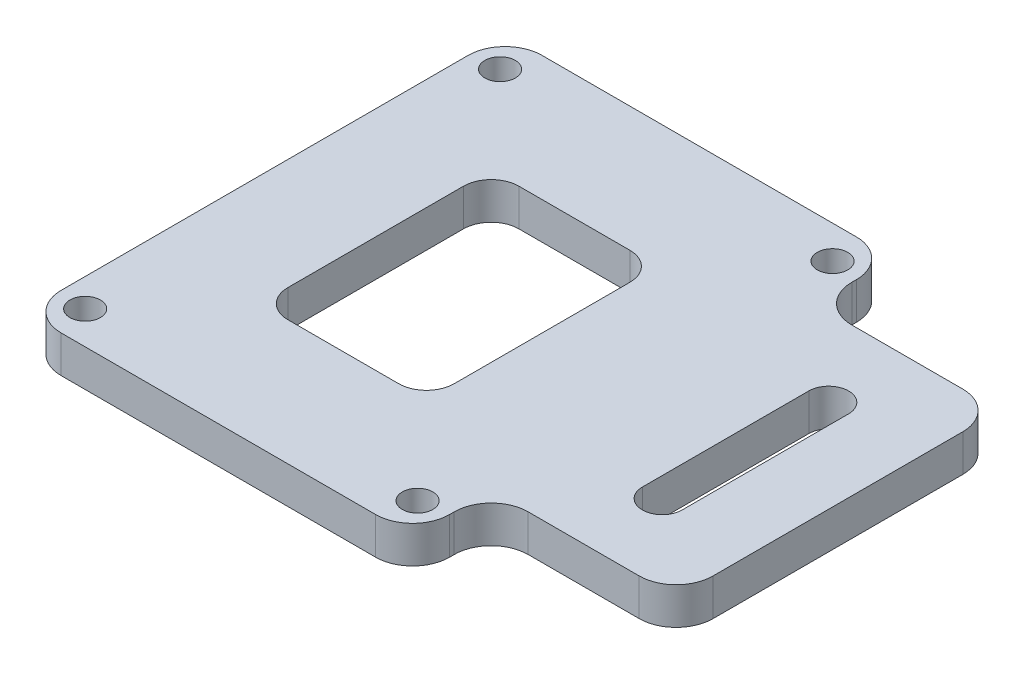
ISO-10303-21;
HEADER;
FILE_DESCRIPTION(('STEP AP214'),'2;1');
FILE_NAME('part.step','',(''),(''),'','','');
FILE_SCHEMA(('AUTOMOTIVE_DESIGN { 1 0 10303 214 1 1 1 1 }'));
ENDSEC;
DATA;
#1=APPLICATION_CONTEXT('core data for automotive mechanical design processes');
#2=APPLICATION_PROTOCOL_DEFINITION('international standard','automotive_design',2000,#1);
#3=PRODUCT_CONTEXT('',#1,'mechanical');
#4=PRODUCT('Part','Part','',(#3));
#5=PRODUCT_RELATED_PRODUCT_CATEGORY('part','',(#4));
#6=PRODUCT_DEFINITION_FORMATION('','',#4);
#7=PRODUCT_DEFINITION_CONTEXT('part definition',#1,'design');
#8=PRODUCT_DEFINITION('design','',#6,#7);
#9=PRODUCT_DEFINITION_SHAPE('','',#8);
#10=(LENGTH_UNIT() NAMED_UNIT(*) SI_UNIT(.MILLI.,.METRE.));
#11=(NAMED_UNIT(*) PLANE_ANGLE_UNIT() SI_UNIT($,.RADIAN.));
#12=(NAMED_UNIT(*) SI_UNIT($,.STERADIAN.) SOLID_ANGLE_UNIT());
#13=UNCERTAINTY_MEASURE_WITH_UNIT(LENGTH_MEASURE(1.E-05),#10,'distance_accuracy_value','');
#14=(GEOMETRIC_REPRESENTATION_CONTEXT(3) GLOBAL_UNCERTAINTY_ASSIGNED_CONTEXT((#13)) GLOBAL_UNIT_ASSIGNED_CONTEXT((#10,
#11,#12)) REPRESENTATION_CONTEXT('',''));
#15=CARTESIAN_POINT('',(0.,0.,0.));
#16=DIRECTION('',(0.,0.,1.));
#17=DIRECTION('',(1.,0.,0.));
#18=AXIS2_PLACEMENT_3D('',#15,#16,#17);
#19=CARTESIAN_POINT('',(21.,4.,26.));
#20=DIRECTION('',(-1.,0.,0.));
#21=DIRECTION('',(0.,0.,1.));
#22=AXIS2_PLACEMENT_3D('',#19,#20,#21);
#23=PLANE('',#22);
#24=DIRECTION('',(0.,0.,-1.));
#25=VECTOR('',#24,1.);
#26=CARTESIAN_POINT('',(21.,4.,26.));
#27=LINE('',#26,#25);
#28=CARTESIAN_POINT('',(21.,4.,-21.5));
#29=VERTEX_POINT('',#28);
#30=CARTESIAN_POINT('',(21.,4.,-22.));
#31=VERTEX_POINT('',#30);
#32=EDGE_CURVE('E309',#29,#31,#27,.T.);
#33=ORIENTED_EDGE('',*,*,#32,.F.);
#34=DIRECTION('',(0.,1.,0.));
#35=VECTOR('',#34,1.);
#36=CARTESIAN_POINT('',(21.,4.,-21.5));
#37=LINE('',#36,#35);
#38=CARTESIAN_POINT('',(21.,0.,-21.5));
#39=VERTEX_POINT('',#38);
#40=EDGE_CURVE('E337',#29,#39,#37,.F.);
#41=ORIENTED_EDGE('',*,*,#40,.T.);
#42=DIRECTION('',(0.,0.,-1.));
#43=VECTOR('',#42,1.);
#44=CARTESIAN_POINT('',(21.,0.,26.));
#45=LINE('',#44,#43);
#46=CARTESIAN_POINT('',(21.,0.,-22.));
#47=VERTEX_POINT('',#46);
#48=EDGE_CURVE('E304',#39,#47,#45,.T.);
#49=ORIENTED_EDGE('',*,*,#48,.T.);
#50=DIRECTION('',(0.,-1.,0.));
#51=VECTOR('',#50,1.);
#52=CARTESIAN_POINT('',(21.,4.,-22.));
#53=LINE('',#52,#51);
#54=EDGE_CURVE('E335',#47,#31,#53,.F.);
#55=ORIENTED_EDGE('',*,*,#54,.T.);
#56=EDGE_LOOP('',(#33,#41,#49,#55));
#57=FACE_BOUND('',#56,.T.);
#58=ADVANCED_FACE('F35',(#57),#23,.F.);
#59=CARTESIAN_POINT('',(21.,0.,22.));
#60=VERTEX_POINT('',#59);
#61=CARTESIAN_POINT('',(21.,0.,21.5));
#62=VERTEX_POINT('',#61);
#63=EDGE_CURVE('E319',#60,#62,#45,.T.);
#64=ORIENTED_EDGE('',*,*,#63,.T.);
#65=DIRECTION('',(0.,1.,0.));
#66=VECTOR('',#65,1.);
#67=CARTESIAN_POINT('',(21.,4.,21.5));
#68=LINE('',#67,#66);
#69=CARTESIAN_POINT('',(21.,4.,21.5));
#70=VERTEX_POINT('',#69);
#71=EDGE_CURVE('E342',#62,#70,#68,.T.);
#72=ORIENTED_EDGE('',*,*,#71,.T.);
#73=CARTESIAN_POINT('',(21.,4.,22.));
#74=VERTEX_POINT('',#73);
#75=EDGE_CURVE('E305',#74,#70,#27,.T.);
#76=ORIENTED_EDGE('',*,*,#75,.F.);
#77=DIRECTION('',(0.,-1.,0.));
#78=VECTOR('',#77,1.);
#79=CARTESIAN_POINT('',(21.,4.,22.));
#80=LINE('',#79,#78);
#81=EDGE_CURVE('E339',#74,#60,#80,.T.);
#82=ORIENTED_EDGE('',*,*,#81,.T.);
#83=EDGE_LOOP('',(#64,#72,#76,#82));
#84=FACE_BOUND('',#83,.T.);
#85=ADVANCED_FACE('F495',(#84),#23,.F.);
#86=CARTESIAN_POINT('',(-21.,4.,-26.));
#87=DIRECTION('',(0.,0.,1.));
#88=DIRECTION('',(1.,0.,0.));
#89=AXIS2_PLACEMENT_3D('',#86,#87,#88);
#90=PLANE('',#89);
#91=DIRECTION('',(-1.,0.,0.));
#92=VECTOR('',#91,1.);
#93=CARTESIAN_POINT('',(-21.,4.,-26.));
#94=LINE('',#93,#92);
#95=CARTESIAN_POINT('',(17.,4.,-26.));
#96=VERTEX_POINT('',#95);
#97=CARTESIAN_POINT('',(-17.,4.,-26.));
#98=VERTEX_POINT('',#97);
#99=EDGE_CURVE('E308',#96,#98,#94,.T.);
#100=ORIENTED_EDGE('',*,*,#99,.F.);
#101=DIRECTION('',(0.,-1.,0.));
#102=VECTOR('',#101,1.);
#103=CARTESIAN_POINT('',(17.,4.,-26.));
#104=LINE('',#103,#102);
#105=CARTESIAN_POINT('',(17.,0.,-26.));
#106=VERTEX_POINT('',#105);
#107=EDGE_CURVE('E381',#96,#106,#104,.T.);
#108=ORIENTED_EDGE('',*,*,#107,.T.);
#109=DIRECTION('',(-1.,0.,0.));
#110=VECTOR('',#109,1.);
#111=CARTESIAN_POINT('',(-21.,0.,-26.));
#112=LINE('',#111,#110);
#113=CARTESIAN_POINT('',(-17.,0.,-26.));
#114=VERTEX_POINT('',#113);
#115=EDGE_CURVE('E322',#106,#114,#112,.T.);
#116=ORIENTED_EDGE('',*,*,#115,.T.);
#117=DIRECTION('',(0.,-1.,0.));
#118=VECTOR('',#117,1.);
#119=CARTESIAN_POINT('',(-17.,4.,-26.));
#120=LINE('',#119,#118);
#121=EDGE_CURVE('E379',#114,#98,#120,.F.);
#122=ORIENTED_EDGE('',*,*,#121,.T.);
#123=EDGE_LOOP('',(#100,#108,#116,#122));
#124=FACE_BOUND('',#123,.T.);
#125=ADVANCED_FACE('F501',(#124),#90,.F.);
#126=CARTESIAN_POINT('',(-21.,4.,26.));
#127=DIRECTION('',(1.,0.,0.));
#128=DIRECTION('',(0.,0.,-1.));
#129=AXIS2_PLACEMENT_3D('',#126,#127,#128);
#130=PLANE('',#129);
#131=DIRECTION('',(0.,0.,1.));
#132=VECTOR('',#131,1.);
#133=CARTESIAN_POINT('',(-21.,0.,26.));
#134=LINE('',#133,#132);
#135=CARTESIAN_POINT('',(-21.,0.,-22.));
#136=VERTEX_POINT('',#135);
#137=CARTESIAN_POINT('',(-21.,0.,22.));
#138=VERTEX_POINT('',#137);
#139=EDGE_CURVE('E325',#136,#138,#134,.T.);
#140=ORIENTED_EDGE('',*,*,#139,.T.);
#141=DIRECTION('',(0.,-1.,0.));
#142=VECTOR('',#141,1.);
#143=CARTESIAN_POINT('',(-21.,4.,22.));
#144=LINE('',#143,#142);
#145=CARTESIAN_POINT('',(-21.,4.,22.));
#146=VERTEX_POINT('',#145);
#147=EDGE_CURVE('E392',#138,#146,#144,.F.);
#148=ORIENTED_EDGE('',*,*,#147,.T.);
#149=DIRECTION('',(0.,0.,1.));
#150=VECTOR('',#149,1.);
#151=CARTESIAN_POINT('',(-21.,4.,26.));
#152=LINE('',#151,#150);
#153=CARTESIAN_POINT('',(-21.,4.,-22.));
#154=VERTEX_POINT('',#153);
#155=EDGE_CURVE('E312',#154,#146,#152,.T.);
#156=ORIENTED_EDGE('',*,*,#155,.F.);
#157=DIRECTION('',(0.,-1.,0.));
#158=VECTOR('',#157,1.);
#159=CARTESIAN_POINT('',(-21.,4.,-22.));
#160=LINE('',#159,#158);
#161=EDGE_CURVE('E389',#154,#136,#160,.T.);
#162=ORIENTED_EDGE('',*,*,#161,.T.);
#163=EDGE_LOOP('',(#140,#148,#156,#162));
#164=FACE_BOUND('',#163,.T.);
#165=ADVANCED_FACE('F598',(#164),#130,.F.);
#166=CARTESIAN_POINT('',(-21.,4.,26.));
#167=DIRECTION('',(0.,0.,-1.));
#168=DIRECTION('',(-1.,0.,0.));
#169=AXIS2_PLACEMENT_3D('',#166,#167,#168);
#170=PLANE('',#169);
#171=DIRECTION('',(1.,0.,0.));
#172=VECTOR('',#171,1.);
#173=CARTESIAN_POINT('',(-21.,0.,26.));
#174=LINE('',#173,#172);
#175=CARTESIAN_POINT('',(-17.,0.,26.));
#176=VERTEX_POINT('',#175);
#177=CARTESIAN_POINT('',(17.,0.,26.));
#178=VERTEX_POINT('',#177);
#179=EDGE_CURVE('E328',#176,#178,#174,.T.);
#180=ORIENTED_EDGE('',*,*,#179,.T.);
#181=DIRECTION('',(0.,-1.,0.));
#182=VECTOR('',#181,1.);
#183=CARTESIAN_POINT('',(17.,4.,26.));
#184=LINE('',#183,#182);
#185=CARTESIAN_POINT('',(17.,4.,26.));
#186=VERTEX_POINT('',#185);
#187=EDGE_CURVE('E387',#178,#186,#184,.F.);
#188=ORIENTED_EDGE('',*,*,#187,.T.);
#189=DIRECTION('',(1.,0.,0.));
#190=VECTOR('',#189,1.);
#191=CARTESIAN_POINT('',(-21.,4.,26.));
#192=LINE('',#191,#190);
#193=CARTESIAN_POINT('',(-17.,4.,26.));
#194=VERTEX_POINT('',#193);
#195=EDGE_CURVE('E315',#194,#186,#192,.T.);
#196=ORIENTED_EDGE('',*,*,#195,.F.);
#197=DIRECTION('',(0.,-1.,0.));
#198=VECTOR('',#197,1.);
#199=CARTESIAN_POINT('',(-17.,4.,26.));
#200=LINE('',#199,#198);
#201=EDGE_CURVE('E384',#194,#176,#200,.T.);
#202=ORIENTED_EDGE('',*,*,#201,.T.);
#203=EDGE_LOOP('',(#180,#188,#196,#202));
#204=FACE_BOUND('',#203,.T.);
#205=ADVANCED_FACE('F594',(#204),#170,.F.);
#206=CARTESIAN_POINT('',(0.,4.,0.));
#207=DIRECTION('',(0.,-1.,0.));
#208=DIRECTION('',(0.,0.,-1.));
#209=AXIS2_PLACEMENT_3D('',#206,#207,#208);
#210=PLANE('',#209);
#211=DIRECTION('',(0.,0.,-1.));
#212=VECTOR('',#211,1.);
#213=CARTESIAN_POINT('',(-9.,4.,0.));
#214=LINE('',#213,#212);
#215=CARTESIAN_POINT('',(-9.,4.,9.5));
#216=VERTEX_POINT('',#215);
#217=CARTESIAN_POINT('',(-9.,4.,-9.5));
#218=VERTEX_POINT('',#217);
#219=EDGE_CURVE('E466',#216,#218,#214,.T.);
#220=ORIENTED_EDGE('',*,*,#219,.T.);
#221=CARTESIAN_POINT('',(-6.,4.,-9.5));
#222=DIRECTION('',(0.,-1.,0.));
#223=DIRECTION('',(0.,0.,-1.));
#224=AXIS2_PLACEMENT_3D('',#221,#222,#223);
#225=CIRCLE('',#224,3.);
#226=CARTESIAN_POINT('',(-6.,4.,-12.5));
#227=VERTEX_POINT('',#226);
#228=EDGE_CURVE('E57',#218,#227,#225,.T.);
#229=ORIENTED_EDGE('',*,*,#228,.T.);
#230=DIRECTION('',(1.,0.,0.));
#231=VECTOR('',#230,1.);
#232=CARTESIAN_POINT('',(0.,4.,-12.5));
#233=LINE('',#232,#231);
#234=CARTESIAN_POINT('',(6.,4.,-12.5));
#235=VERTEX_POINT('',#234);
#236=EDGE_CURVE('E440',#227,#235,#233,.T.);
#237=ORIENTED_EDGE('',*,*,#236,.T.);
#238=CARTESIAN_POINT('',(6.,4.,-9.5));
#239=DIRECTION('',(0.,-1.,0.));
#240=DIRECTION('',(0.,0.,-1.));
#241=AXIS2_PLACEMENT_3D('',#238,#239,#240);
#242=CIRCLE('',#241,3.);
#243=CARTESIAN_POINT('',(9.,4.,-9.5));
#244=VERTEX_POINT('',#243);
#245=EDGE_CURVE('E43',#235,#244,#242,.T.);
#246=ORIENTED_EDGE('',*,*,#245,.T.);
#247=DIRECTION('',(0.,0.,1.));
#248=VECTOR('',#247,1.);
#249=CARTESIAN_POINT('',(9.,4.,0.));
#250=LINE('',#249,#248);
#251=CARTESIAN_POINT('',(9.,4.,9.5));
#252=VERTEX_POINT('',#251);
#253=EDGE_CURVE('E246',#244,#252,#250,.T.);
#254=ORIENTED_EDGE('',*,*,#253,.T.);
#255=CARTESIAN_POINT('',(6.,4.,9.5));
#256=DIRECTION('',(0.,-1.,0.));
#257=DIRECTION('',(0.,0.,-1.));
#258=AXIS2_PLACEMENT_3D('',#255,#256,#257);
#259=CIRCLE('',#258,3.);
#260=CARTESIAN_POINT('',(6.,4.,12.5));
#261=VERTEX_POINT('',#260);
#262=EDGE_CURVE('E427',#252,#261,#259,.T.);
#263=ORIENTED_EDGE('',*,*,#262,.T.);
#264=DIRECTION('',(-1.,0.,0.));
#265=VECTOR('',#264,1.);
#266=CARTESIAN_POINT('',(0.,4.,12.5));
#267=LINE('',#266,#265);
#268=CARTESIAN_POINT('',(-6.,4.,12.5));
#269=VERTEX_POINT('',#268);
#270=EDGE_CURVE('E249',#261,#269,#267,.T.);
#271=ORIENTED_EDGE('',*,*,#270,.T.);
#272=CARTESIAN_POINT('',(-6.,4.,9.5));
#273=DIRECTION('',(0.,-1.,0.));
#274=DIRECTION('',(0.,0.,-1.));
#275=AXIS2_PLACEMENT_3D('',#272,#273,#274);
#276=CIRCLE('',#275,3.);
#277=EDGE_CURVE('E431',#269,#216,#276,.T.);
#278=ORIENTED_EDGE('',*,*,#277,.T.);
#279=EDGE_LOOP('',(#220,#229,#237,#246,#254,#263,#271,#278));
#280=FACE_BOUND('',#279,.T.);
#281=DIRECTION('',(0.,0.,-1.));
#282=VECTOR('',#281,1.);
#283=CARTESIAN_POINT('',(33.15,4.,9.00000000000001));
#284=LINE('',#283,#282);
#285=CARTESIAN_POINT('',(33.15,4.,9.00000000000001));
#286=VERTEX_POINT('',#285);
#287=CARTESIAN_POINT('',(33.15,4.,-8.99999999999999));
#288=VERTEX_POINT('',#287);
#289=EDGE_CURVE('E259',#286,#288,#284,.T.);
#290=ORIENTED_EDGE('',*,*,#289,.F.);
#291=CARTESIAN_POINT('',(31.,4.,9.00000000000001));
#292=DIRECTION('',(0.,1.,0.));
#293=DIRECTION('',(0.,0.,1.));
#294=AXIS2_PLACEMENT_3D('',#291,#292,#293);
#295=CIRCLE('',#294,2.15);
#296=CARTESIAN_POINT('',(28.85,4.,9.00000000000001));
#297=VERTEX_POINT('',#296);
#298=EDGE_CURVE('E228',#297,#286,#295,.T.);
#299=ORIENTED_EDGE('',*,*,#298,.F.);
#300=DIRECTION('',(0.,0.,1.));
#301=VECTOR('',#300,1.);
#302=CARTESIAN_POINT('',(28.85,4.,9.00000000000001));
#303=LINE('',#302,#301);
#304=CARTESIAN_POINT('',(28.85,4.,-8.99999999999999));
#305=VERTEX_POINT('',#304);
#306=EDGE_CURVE('E406',#305,#297,#303,.T.);
#307=ORIENTED_EDGE('',*,*,#306,.F.);
#308=CARTESIAN_POINT('',(31.,4.,-8.99999999999999));
#309=DIRECTION('',(0.,1.,0.));
#310=DIRECTION('',(0.,0.,1.));
#311=AXIS2_PLACEMENT_3D('',#308,#309,#310);
#312=CIRCLE('',#311,2.15);
#313=EDGE_CURVE('E404',#288,#305,#312,.T.);
#314=ORIENTED_EDGE('',*,*,#313,.F.);
#315=EDGE_LOOP('',(#290,#299,#307,#314));
#316=FACE_BOUND('',#315,.T.);
#317=CARTESIAN_POINT('',(-17.975,4.,22.4375));
#318=DIRECTION('',(0.,-1.,0.));
#319=DIRECTION('',(0.,0.,-1.));
#320=AXIS2_PLACEMENT_3D('',#317,#318,#319);
#321=CIRCLE('',#320,1.65);
#322=CARTESIAN_POINT('',(-17.975,4.,20.7875));
#323=VERTEX_POINT('',#322);
#324=EDGE_CURVE('E301',#323,#323,#321,.T.);
#325=ORIENTED_EDGE('',*,*,#324,.T.);
#326=EDGE_LOOP('',(#325));
#327=FACE_BOUND('',#326,.T.);
#328=CARTESIAN_POINT('',(17.975,4.,22.4375));
#329=DIRECTION('',(0.,-1.,0.));
#330=DIRECTION('',(0.,0.,-1.));
#331=AXIS2_PLACEMENT_3D('',#328,#329,#330);
#332=CIRCLE('',#331,1.65);
#333=CARTESIAN_POINT('',(17.975,4.,20.7875));
#334=VERTEX_POINT('',#333);
#335=EDGE_CURVE('E298',#334,#334,#332,.T.);
#336=ORIENTED_EDGE('',*,*,#335,.T.);
#337=EDGE_LOOP('',(#336));
#338=FACE_BOUND('',#337,.T.);
#339=CARTESIAN_POINT('',(17.975,4.,-22.4375));
#340=DIRECTION('',(0.,-1.,0.));
#341=DIRECTION('',(0.,0.,-1.));
#342=AXIS2_PLACEMENT_3D('',#339,#340,#341);
#343=CIRCLE('',#342,1.65);
#344=CARTESIAN_POINT('',(17.975,4.,-24.0875));
#345=VERTEX_POINT('',#344);
#346=EDGE_CURVE('E295',#345,#345,#343,.T.);
#347=ORIENTED_EDGE('',*,*,#346,.T.);
#348=EDGE_LOOP('',(#347));
#349=FACE_BOUND('',#348,.T.);
#350=CARTESIAN_POINT('',(-17.975,4.,-22.4375));
#351=DIRECTION('',(0.,-1.,0.));
#352=DIRECTION('',(0.,0.,-1.));
#353=AXIS2_PLACEMENT_3D('',#350,#351,#352);
#354=CIRCLE('',#353,1.65);
#355=CARTESIAN_POINT('',(-17.975,4.,-24.0875));
#356=VERTEX_POINT('',#355);
#357=EDGE_CURVE('E292',#356,#356,#354,.T.);
#358=ORIENTED_EDGE('',*,*,#357,.T.);
#359=EDGE_LOOP('',(#358));
#360=FACE_BOUND('',#359,.T.);
#361=DIRECTION('',(1.,0.,0.));
#362=VECTOR('',#361,1.);
#363=CARTESIAN_POINT('',(41.,4.,17.5));
#364=LINE('',#363,#362);
#365=CARTESIAN_POINT('',(25.,4.,17.5));
#366=VERTEX_POINT('',#365);
#367=CARTESIAN_POINT('',(37.,4.,17.5));
#368=VERTEX_POINT('',#367);
#369=EDGE_CURVE('E273',#366,#368,#364,.T.);
#370=ORIENTED_EDGE('',*,*,#369,.T.);
#371=CARTESIAN_POINT('',(37.,4.,13.5));
#372=DIRECTION('',(0.,-1.,0.));
#373=DIRECTION('',(0.,0.,-1.));
#374=AXIS2_PLACEMENT_3D('',#371,#372,#373);
#375=CIRCLE('',#374,4.);
#376=CARTESIAN_POINT('',(41.,4.,13.5));
#377=VERTEX_POINT('',#376);
#378=EDGE_CURVE('E360',#368,#377,#375,.F.);
#379=ORIENTED_EDGE('',*,*,#378,.T.);
#380=DIRECTION('',(0.,0.,-1.));
#381=VECTOR('',#380,1.);
#382=CARTESIAN_POINT('',(41.,4.,-17.5));
#383=LINE('',#382,#381);
#384=CARTESIAN_POINT('',(41.,4.,-13.5));
#385=VERTEX_POINT('',#384);
#386=EDGE_CURVE('E276',#377,#385,#383,.T.);
#387=ORIENTED_EDGE('',*,*,#386,.T.);
#388=CARTESIAN_POINT('',(37.,4.,-13.5));
#389=DIRECTION('',(0.,-1.,0.));
#390=DIRECTION('',(0.,0.,-1.));
#391=AXIS2_PLACEMENT_3D('',#388,#389,#390);
#392=CIRCLE('',#391,4.);
#393=CARTESIAN_POINT('',(37.,4.,-17.5));
#394=VERTEX_POINT('',#393);
#395=EDGE_CURVE('E358',#385,#394,#392,.F.);
#396=ORIENTED_EDGE('',*,*,#395,.T.);
#397=DIRECTION('',(-1.,0.,0.));
#398=VECTOR('',#397,1.);
#399=CARTESIAN_POINT('',(41.,4.,-17.5));
#400=LINE('',#399,#398);
#401=CARTESIAN_POINT('',(25.,4.,-17.5));
#402=VERTEX_POINT('',#401);
#403=EDGE_CURVE('E266',#394,#402,#400,.T.);
#404=ORIENTED_EDGE('',*,*,#403,.T.);
#405=CARTESIAN_POINT('',(25.,4.,-21.5));
#406=DIRECTION('',(0.,-1.,0.));
#407=DIRECTION('',(0.,0.,-1.));
#408=AXIS2_PLACEMENT_3D('',#405,#406,#407);
#409=CIRCLE('',#408,4.);
#410=EDGE_CURVE('E394',#402,#29,#409,.T.);
#411=ORIENTED_EDGE('',*,*,#410,.T.);
#412=ORIENTED_EDGE('',*,*,#32,.T.);
#413=CARTESIAN_POINT('',(17.,4.,-22.));
#414=DIRECTION('',(0.,-1.,0.));
#415=DIRECTION('',(0.,0.,-1.));
#416=AXIS2_PLACEMENT_3D('',#413,#414,#415);
#417=CIRCLE('',#416,4.);
#418=EDGE_CURVE('E356',#31,#96,#417,.F.);
#419=ORIENTED_EDGE('',*,*,#418,.T.);
#420=ORIENTED_EDGE('',*,*,#99,.T.);
#421=CARTESIAN_POINT('',(-17.,4.,-22.));
#422=DIRECTION('',(0.,-1.,0.));
#423=DIRECTION('',(0.,0.,-1.));
#424=AXIS2_PLACEMENT_3D('',#421,#422,#423);
#425=CIRCLE('',#424,4.);
#426=EDGE_CURVE('E350',#98,#154,#425,.F.);
#427=ORIENTED_EDGE('',*,*,#426,.T.);
#428=ORIENTED_EDGE('',*,*,#155,.T.);
#429=CARTESIAN_POINT('',(-17.,4.,22.));
#430=DIRECTION('',(0.,-1.,0.));
#431=DIRECTION('',(0.,0.,-1.));
#432=AXIS2_PLACEMENT_3D('',#429,#430,#431);
#433=CIRCLE('',#432,4.);
#434=EDGE_CURVE('E352',#146,#194,#433,.F.);
#435=ORIENTED_EDGE('',*,*,#434,.T.);
#436=ORIENTED_EDGE('',*,*,#195,.T.);
#437=CARTESIAN_POINT('',(17.,4.,22.));
#438=DIRECTION('',(0.,-1.,0.));
#439=DIRECTION('',(0.,0.,-1.));
#440=AXIS2_PLACEMENT_3D('',#437,#438,#439);
#441=CIRCLE('',#440,4.);
#442=EDGE_CURVE('E354',#186,#74,#441,.F.);
#443=ORIENTED_EDGE('',*,*,#442,.T.);
#444=ORIENTED_EDGE('',*,*,#75,.T.);
#445=CARTESIAN_POINT('',(25.,4.,21.5));
#446=DIRECTION('',(0.,-1.,0.));
#447=DIRECTION('',(0.,0.,-1.));
#448=AXIS2_PLACEMENT_3D('',#445,#446,#447);
#449=CIRCLE('',#448,4.);
#450=EDGE_CURVE('E398',#70,#366,#449,.T.);
#451=ORIENTED_EDGE('',*,*,#450,.T.);
#452=EDGE_LOOP('',(#370,#379,#387,#396,#404,#411,#412,#419,#420,#427,#428,#435,#436,#443,#444,#451));
#453=FACE_BOUND('',#452,.T.);
#454=ADVANCED_FACE('F438',(#280,#316,#327,#338,#349,#360,#453),#210,.F.);
#455=CARTESIAN_POINT('',(0.,0.,0.));
#456=DIRECTION('',(0.,-1.,0.));
#457=DIRECTION('',(0.,0.,-1.));
#458=AXIS2_PLACEMENT_3D('',#455,#456,#457);
#459=PLANE('',#458);
#460=DIRECTION('',(1.,0.,0.));
#461=VECTOR('',#460,1.);
#462=CARTESIAN_POINT('',(-9.,0.,12.5));
#463=LINE('',#462,#461);
#464=CARTESIAN_POINT('',(-6.,0.,12.5));
#465=VERTEX_POINT('',#464);
#466=CARTESIAN_POINT('',(6.,0.,12.5));
#467=VERTEX_POINT('',#466);
#468=EDGE_CURVE('E460',#465,#467,#463,.T.);
#469=ORIENTED_EDGE('',*,*,#468,.T.);
#470=CARTESIAN_POINT('',(6.,0.,9.5));
#471=DIRECTION('',(0.,-1.,0.));
#472=DIRECTION('',(0.,0.,-1.));
#473=AXIS2_PLACEMENT_3D('',#470,#471,#472);
#474=CIRCLE('',#473,3.);
#475=CARTESIAN_POINT('',(9.,0.,9.5));
#476=VERTEX_POINT('',#475);
#477=EDGE_CURVE('E429',#467,#476,#474,.F.);
#478=ORIENTED_EDGE('',*,*,#477,.T.);
#479=DIRECTION('',(0.,0.,-1.));
#480=VECTOR('',#479,1.);
#481=CARTESIAN_POINT('',(9.,0.,12.5));
#482=LINE('',#481,#480);
#483=CARTESIAN_POINT('',(9.,0.,-9.5));
#484=VERTEX_POINT('',#483);
#485=EDGE_CURVE('E453',#476,#484,#482,.T.);
#486=ORIENTED_EDGE('',*,*,#485,.T.);
#487=CARTESIAN_POINT('',(6.,0.,-9.5));
#488=DIRECTION('',(0.,-1.,0.));
#489=DIRECTION('',(0.,0.,-1.));
#490=AXIS2_PLACEMENT_3D('',#487,#488,#489);
#491=CIRCLE('',#490,3.);
#492=CARTESIAN_POINT('',(6.,0.,-12.5));
#493=VERTEX_POINT('',#492);
#494=EDGE_CURVE('E11',#484,#493,#491,.F.);
#495=ORIENTED_EDGE('',*,*,#494,.T.);
#496=DIRECTION('',(-1.,0.,0.));
#497=VECTOR('',#496,1.);
#498=CARTESIAN_POINT('',(-9.,0.,-12.5));
#499=LINE('',#498,#497);
#500=CARTESIAN_POINT('',(-6.,0.,-12.5));
#501=VERTEX_POINT('',#500);
#502=EDGE_CURVE('E451',#493,#501,#499,.T.);
#503=ORIENTED_EDGE('',*,*,#502,.T.);
#504=CARTESIAN_POINT('',(-6.,0.,-9.5));
#505=DIRECTION('',(0.,-1.,0.));
#506=DIRECTION('',(0.,0.,-1.));
#507=AXIS2_PLACEMENT_3D('',#504,#505,#506);
#508=CIRCLE('',#507,3.);
#509=CARTESIAN_POINT('',(-9.,0.,-9.5));
#510=VERTEX_POINT('',#509);
#511=EDGE_CURVE('E436',#501,#510,#508,.F.);
#512=ORIENTED_EDGE('',*,*,#511,.T.);
#513=DIRECTION('',(0.,0.,1.));
#514=VECTOR('',#513,1.);
#515=CARTESIAN_POINT('',(-9.,0.,12.5));
#516=LINE('',#515,#514);
#517=CARTESIAN_POINT('',(-9.,0.,9.5));
#518=VERTEX_POINT('',#517);
#519=EDGE_CURVE('E457',#510,#518,#516,.T.);
#520=ORIENTED_EDGE('',*,*,#519,.T.);
#521=CARTESIAN_POINT('',(-6.,0.,9.5));
#522=DIRECTION('',(0.,-1.,0.));
#523=DIRECTION('',(0.,0.,-1.));
#524=AXIS2_PLACEMENT_3D('',#521,#522,#523);
#525=CIRCLE('',#524,3.);
#526=EDGE_CURVE('E433',#518,#465,#525,.F.);
#527=ORIENTED_EDGE('',*,*,#526,.T.);
#528=EDGE_LOOP('',(#469,#478,#486,#495,#503,#512,#520,#527));
#529=FACE_BOUND('',#528,.T.);
#530=CARTESIAN_POINT('',(31.,0.,9.00000000000001));
#531=DIRECTION('',(0.,1.,0.));
#532=DIRECTION('',(0.,0.,1.));
#533=AXIS2_PLACEMENT_3D('',#530,#531,#532);
#534=CIRCLE('',#533,2.15);
#535=CARTESIAN_POINT('',(28.85,0.,9.00000000000001));
#536=VERTEX_POINT('',#535);
#537=CARTESIAN_POINT('',(33.15,0.,9.00000000000001));
#538=VERTEX_POINT('',#537);
#539=EDGE_CURVE('E225',#536,#538,#534,.T.);
#540=ORIENTED_EDGE('',*,*,#539,.T.);
#541=DIRECTION('',(0.,0.,-1.));
#542=VECTOR('',#541,1.);
#543=CARTESIAN_POINT('',(33.15,0.,9.00000000000001));
#544=LINE('',#543,#542);
#545=CARTESIAN_POINT('',(33.15,0.,-8.99999999999999));
#546=VERTEX_POINT('',#545);
#547=EDGE_CURVE('E236',#538,#546,#544,.T.);
#548=ORIENTED_EDGE('',*,*,#547,.T.);
#549=CARTESIAN_POINT('',(31.,0.,-8.99999999999999));
#550=DIRECTION('',(0.,1.,0.));
#551=DIRECTION('',(0.,0.,1.));
#552=AXIS2_PLACEMENT_3D('',#549,#550,#551);
#553=CIRCLE('',#552,2.15);
#554=CARTESIAN_POINT('',(28.85,0.,-8.99999999999999));
#555=VERTEX_POINT('',#554);
#556=EDGE_CURVE('E241',#546,#555,#553,.T.);
#557=ORIENTED_EDGE('',*,*,#556,.T.);
#558=DIRECTION('',(0.,0.,1.));
#559=VECTOR('',#558,1.);
#560=CARTESIAN_POINT('',(28.85,0.,9.00000000000001));
#561=LINE('',#560,#559);
#562=EDGE_CURVE('E232',#555,#536,#561,.T.);
#563=ORIENTED_EDGE('',*,*,#562,.T.);
#564=EDGE_LOOP('',(#540,#548,#557,#563));
#565=FACE_BOUND('',#564,.T.);
#566=CARTESIAN_POINT('',(-17.975,0.,22.4375));
#567=DIRECTION('',(0.,1.,0.));
#568=DIRECTION('',(0.,0.,1.));
#569=AXIS2_PLACEMENT_3D('',#566,#567,#568);
#570=CIRCLE('',#569,1.65);
#571=CARTESIAN_POINT('',(-17.975,0.,24.0875));
#572=VERTEX_POINT('',#571);
#573=EDGE_CURVE('E272',#572,#572,#570,.T.);
#574=ORIENTED_EDGE('',*,*,#573,.T.);
#575=EDGE_LOOP('',(#574));
#576=FACE_BOUND('',#575,.T.);
#577=CARTESIAN_POINT('',(17.975,0.,22.4375));
#578=DIRECTION('',(0.,1.,0.));
#579=DIRECTION('',(0.,0.,1.));
#580=AXIS2_PLACEMENT_3D('',#577,#578,#579);
#581=CIRCLE('',#580,1.65);
#582=CARTESIAN_POINT('',(17.975,0.,24.0875));
#583=VERTEX_POINT('',#582);
#584=EDGE_CURVE('E285',#583,#583,#581,.T.);
#585=ORIENTED_EDGE('',*,*,#584,.T.);
#586=EDGE_LOOP('',(#585));
#587=FACE_BOUND('',#586,.T.);
#588=CARTESIAN_POINT('',(17.975,0.,-22.4375));
#589=DIRECTION('',(0.,1.,0.));
#590=DIRECTION('',(0.,0.,1.));
#591=AXIS2_PLACEMENT_3D('',#588,#589,#590);
#592=CIRCLE('',#591,1.65);
#593=CARTESIAN_POINT('',(17.975,0.,-20.7875));
#594=VERTEX_POINT('',#593);
#595=EDGE_CURVE('E281',#594,#594,#592,.T.);
#596=ORIENTED_EDGE('',*,*,#595,.T.);
#597=EDGE_LOOP('',(#596));
#598=FACE_BOUND('',#597,.T.);
#599=CARTESIAN_POINT('',(-17.975,0.,-22.4375));
#600=DIRECTION('',(0.,1.,0.));
#601=DIRECTION('',(0.,0.,1.));
#602=AXIS2_PLACEMENT_3D('',#599,#600,#601);
#603=CIRCLE('',#602,1.65);
#604=CARTESIAN_POINT('',(-17.975,0.,-20.7875));
#605=VERTEX_POINT('',#604);
#606=EDGE_CURVE('E284',#605,#605,#603,.T.);
#607=ORIENTED_EDGE('',*,*,#606,.T.);
#608=EDGE_LOOP('',(#607));
#609=FACE_BOUND('',#608,.T.);
#610=DIRECTION('',(0.,0.,-1.));
#611=VECTOR('',#610,1.);
#612=CARTESIAN_POINT('',(41.,0.,-17.5));
#613=LINE('',#612,#611);
#614=CARTESIAN_POINT('',(41.,0.,13.5));
#615=VERTEX_POINT('',#614);
#616=CARTESIAN_POINT('',(41.,0.,-13.5));
#617=VERTEX_POINT('',#616);
#618=EDGE_CURVE('E265',#615,#617,#613,.T.);
#619=ORIENTED_EDGE('',*,*,#618,.F.);
#620=CARTESIAN_POINT('',(37.,0.,13.5));
#621=DIRECTION('',(0.,-1.,0.));
#622=DIRECTION('',(0.,0.,-1.));
#623=AXIS2_PLACEMENT_3D('',#620,#621,#622);
#624=CIRCLE('',#623,4.);
#625=CARTESIAN_POINT('',(37.,0.,17.5));
#626=VERTEX_POINT('',#625);
#627=EDGE_CURVE('E377',#615,#626,#624,.T.);
#628=ORIENTED_EDGE('',*,*,#627,.T.);
#629=DIRECTION('',(1.,0.,0.));
#630=VECTOR('',#629,1.);
#631=CARTESIAN_POINT('',(41.,0.,17.5));
#632=LINE('',#631,#630);
#633=CARTESIAN_POINT('',(25.,0.,17.5));
#634=VERTEX_POINT('',#633);
#635=EDGE_CURVE('E262',#634,#626,#632,.T.);
#636=ORIENTED_EDGE('',*,*,#635,.F.);
#637=CARTESIAN_POINT('',(25.,0.,21.5));
#638=DIRECTION('',(0.,-1.,0.));
#639=DIRECTION('',(0.,0.,-1.));
#640=AXIS2_PLACEMENT_3D('',#637,#638,#639);
#641=CIRCLE('',#640,4.);
#642=EDGE_CURVE('E400',#634,#62,#641,.F.);
#643=ORIENTED_EDGE('',*,*,#642,.T.);
#644=ORIENTED_EDGE('',*,*,#63,.F.);
#645=CARTESIAN_POINT('',(17.,0.,22.));
#646=DIRECTION('',(0.,-1.,0.));
#647=DIRECTION('',(0.,0.,-1.));
#648=AXIS2_PLACEMENT_3D('',#645,#646,#647);
#649=CIRCLE('',#648,4.);
#650=EDGE_CURVE('E371',#60,#178,#649,.T.);
#651=ORIENTED_EDGE('',*,*,#650,.T.);
#652=ORIENTED_EDGE('',*,*,#179,.F.);
#653=CARTESIAN_POINT('',(-17.,0.,22.));
#654=DIRECTION('',(0.,-1.,0.));
#655=DIRECTION('',(0.,0.,-1.));
#656=AXIS2_PLACEMENT_3D('',#653,#654,#655);
#657=CIRCLE('',#656,4.);
#658=EDGE_CURVE('E369',#176,#138,#657,.T.);
#659=ORIENTED_EDGE('',*,*,#658,.T.);
#660=ORIENTED_EDGE('',*,*,#139,.F.);
#661=CARTESIAN_POINT('',(-17.,0.,-22.));
#662=DIRECTION('',(0.,-1.,0.));
#663=DIRECTION('',(0.,0.,-1.));
#664=AXIS2_PLACEMENT_3D('',#661,#662,#663);
#665=CIRCLE('',#664,4.);
#666=EDGE_CURVE('E367',#136,#114,#665,.T.);
#667=ORIENTED_EDGE('',*,*,#666,.T.);
#668=ORIENTED_EDGE('',*,*,#115,.F.);
#669=CARTESIAN_POINT('',(17.,0.,-22.));
#670=DIRECTION('',(0.,-1.,0.));
#671=DIRECTION('',(0.,0.,-1.));
#672=AXIS2_PLACEMENT_3D('',#669,#670,#671);
#673=CIRCLE('',#672,4.);
#674=EDGE_CURVE('E373',#106,#47,#673,.T.);
#675=ORIENTED_EDGE('',*,*,#674,.T.);
#676=ORIENTED_EDGE('',*,*,#48,.F.);
#677=CARTESIAN_POINT('',(25.,0.,-21.5));
#678=DIRECTION('',(0.,-1.,0.));
#679=DIRECTION('',(0.,0.,-1.));
#680=AXIS2_PLACEMENT_3D('',#677,#678,#679);
#681=CIRCLE('',#680,4.);
#682=CARTESIAN_POINT('',(25.,0.,-17.5));
#683=VERTEX_POINT('',#682);
#684=EDGE_CURVE('E396',#39,#683,#681,.F.);
#685=ORIENTED_EDGE('',*,*,#684,.T.);
#686=DIRECTION('',(-1.,0.,0.));
#687=VECTOR('',#686,1.);
#688=CARTESIAN_POINT('',(41.,0.,-17.5));
#689=LINE('',#688,#687);
#690=CARTESIAN_POINT('',(37.,0.,-17.5));
#691=VERTEX_POINT('',#690);
#692=EDGE_CURVE('E269',#691,#683,#689,.T.);
#693=ORIENTED_EDGE('',*,*,#692,.F.);
#694=CARTESIAN_POINT('',(37.,0.,-13.5));
#695=DIRECTION('',(0.,-1.,0.));
#696=DIRECTION('',(0.,0.,-1.));
#697=AXIS2_PLACEMENT_3D('',#694,#695,#696);
#698=CIRCLE('',#697,4.);
#699=EDGE_CURVE('E375',#691,#617,#698,.T.);
#700=ORIENTED_EDGE('',*,*,#699,.T.);
#701=EDGE_LOOP('',(#619,#628,#636,#643,#644,#651,#652,#659,#660,#667,#668,#675,#676,#685,#693,#700));
#702=FACE_BOUND('',#701,.T.);
#703=ADVANCED_FACE('F243',(#529,#565,#576,#587,#598,#609,#702),#459,.T.);
#704=CARTESIAN_POINT('',(-17.975,0.,-22.4375));
#705=DIRECTION('',(0.,1.,0.));
#706=DIRECTION('',(0.,0.,1.));
#707=AXIS2_PLACEMENT_3D('',#704,#705,#706);
#708=CYLINDRICAL_SURFACE('',#707,1.65);
#709=ORIENTED_EDGE('',*,*,#606,.F.);
#710=EDGE_LOOP('',(#709));
#711=FACE_BOUND('',#710,.T.);
#712=ORIENTED_EDGE('',*,*,#357,.F.);
#713=EDGE_LOOP('',(#712));
#714=FACE_BOUND('',#713,.T.);
#715=ADVANCED_FACE('F581',(#711,#714),#708,.F.);
#716=CARTESIAN_POINT('',(17.975,0.,-22.4375));
#717=DIRECTION('',(0.,1.,0.));
#718=DIRECTION('',(0.,0.,1.));
#719=AXIS2_PLACEMENT_3D('',#716,#717,#718);
#720=CYLINDRICAL_SURFACE('',#719,1.65);
#721=ORIENTED_EDGE('',*,*,#595,.F.);
#722=EDGE_LOOP('',(#721));
#723=FACE_BOUND('',#722,.T.);
#724=ORIENTED_EDGE('',*,*,#346,.F.);
#725=EDGE_LOOP('',(#724));
#726=FACE_BOUND('',#725,.T.);
#727=ADVANCED_FACE('F577',(#723,#726),#720,.F.);
#728=CARTESIAN_POINT('',(17.975,0.,22.4375));
#729=DIRECTION('',(0.,1.,0.));
#730=DIRECTION('',(0.,0.,1.));
#731=AXIS2_PLACEMENT_3D('',#728,#729,#730);
#732=CYLINDRICAL_SURFACE('',#731,1.65);
#733=ORIENTED_EDGE('',*,*,#584,.F.);
#734=EDGE_LOOP('',(#733));
#735=FACE_BOUND('',#734,.T.);
#736=ORIENTED_EDGE('',*,*,#335,.F.);
#737=EDGE_LOOP('',(#736));
#738=FACE_BOUND('',#737,.T.);
#739=ADVANCED_FACE('F580',(#735,#738),#732,.F.);
#740=CARTESIAN_POINT('',(-17.975,0.,22.4375));
#741=DIRECTION('',(0.,1.,0.));
#742=DIRECTION('',(0.,0.,1.));
#743=AXIS2_PLACEMENT_3D('',#740,#741,#742);
#744=CYLINDRICAL_SURFACE('',#743,1.65);
#745=ORIENTED_EDGE('',*,*,#573,.F.);
#746=EDGE_LOOP('',(#745));
#747=FACE_BOUND('',#746,.T.);
#748=ORIENTED_EDGE('',*,*,#324,.F.);
#749=EDGE_LOOP('',(#748));
#750=FACE_BOUND('',#749,.T.);
#751=ADVANCED_FACE('F569',(#747,#750),#744,.F.);
#752=CARTESIAN_POINT('',(41.,0.,-17.5));
#753=DIRECTION('',(0.,0.,-1.));
#754=DIRECTION('',(-1.,0.,0.));
#755=AXIS2_PLACEMENT_3D('',#752,#753,#754);
#756=PLANE('',#755);
#757=ORIENTED_EDGE('',*,*,#692,.T.);
#758=DIRECTION('',(0.,1.,0.));
#759=VECTOR('',#758,1.);
#760=CARTESIAN_POINT('',(25.,0.,-17.5));
#761=LINE('',#760,#759);
#762=EDGE_CURVE('E332',#683,#402,#761,.T.);
#763=ORIENTED_EDGE('',*,*,#762,.T.);
#764=ORIENTED_EDGE('',*,*,#403,.F.);
#765=DIRECTION('',(0.,1.,0.));
#766=VECTOR('',#765,1.);
#767=CARTESIAN_POINT('',(37.,0.,-17.5));
#768=LINE('',#767,#766);
#769=EDGE_CURVE('E318',#394,#691,#768,.F.);
#770=ORIENTED_EDGE('',*,*,#769,.T.);
#771=EDGE_LOOP('',(#757,#763,#764,#770));
#772=FACE_BOUND('',#771,.T.);
#773=ADVANCED_FACE('F565',(#772),#756,.T.);
#774=CARTESIAN_POINT('',(41.,0.,-17.5));
#775=DIRECTION('',(1.,0.,0.));
#776=DIRECTION('',(0.,0.,-1.));
#777=AXIS2_PLACEMENT_3D('',#774,#775,#776);
#778=PLANE('',#777);
#779=ORIENTED_EDGE('',*,*,#386,.F.);
#780=DIRECTION('',(0.,1.,0.));
#781=VECTOR('',#780,1.);
#782=CARTESIAN_POINT('',(41.,0.,13.5));
#783=LINE('',#782,#781);
#784=EDGE_CURVE('E365',#377,#615,#783,.F.);
#785=ORIENTED_EDGE('',*,*,#784,.T.);
#786=ORIENTED_EDGE('',*,*,#618,.T.);
#787=DIRECTION('',(0.,1.,0.));
#788=VECTOR('',#787,1.);
#789=CARTESIAN_POINT('',(41.,0.,-13.5));
#790=LINE('',#789,#788);
#791=EDGE_CURVE('E362',#617,#385,#790,.T.);
#792=ORIENTED_EDGE('',*,*,#791,.T.);
#793=EDGE_LOOP('',(#779,#785,#786,#792));
#794=FACE_BOUND('',#793,.T.);
#795=ADVANCED_FACE('F568',(#794),#778,.T.);
#796=CARTESIAN_POINT('',(41.,0.,17.5));
#797=DIRECTION('',(0.,0.,1.));
#798=DIRECTION('',(1.,0.,0.));
#799=AXIS2_PLACEMENT_3D('',#796,#797,#798);
#800=PLANE('',#799);
#801=ORIENTED_EDGE('',*,*,#369,.F.);
#802=DIRECTION('',(0.,1.,0.));
#803=VECTOR('',#802,1.);
#804=CARTESIAN_POINT('',(25.,0.,17.5));
#805=LINE('',#804,#803);
#806=EDGE_CURVE('E348',#366,#634,#805,.F.);
#807=ORIENTED_EDGE('',*,*,#806,.T.);
#808=ORIENTED_EDGE('',*,*,#635,.T.);
#809=DIRECTION('',(0.,1.,0.));
#810=VECTOR('',#809,1.);
#811=CARTESIAN_POINT('',(37.,0.,17.5));
#812=LINE('',#811,#810);
#813=EDGE_CURVE('E345',#626,#368,#812,.T.);
#814=ORIENTED_EDGE('',*,*,#813,.T.);
#815=EDGE_LOOP('',(#801,#807,#808,#814));
#816=FACE_BOUND('',#815,.T.);
#817=ADVANCED_FACE('F511',(#816),#800,.T.);
#818=CARTESIAN_POINT('',(25.,0.,-21.5));
#819=DIRECTION('',(0.,1.,0.));
#820=DIRECTION('',(0.,0.,1.));
#821=AXIS2_PLACEMENT_3D('',#818,#819,#820);
#822=CYLINDRICAL_SURFACE('',#821,4.);
#823=ORIENTED_EDGE('',*,*,#684,.F.);
#824=ORIENTED_EDGE('',*,*,#40,.F.);
#825=ORIENTED_EDGE('',*,*,#410,.F.);
#826=ORIENTED_EDGE('',*,*,#762,.F.);
#827=EDGE_LOOP('',(#823,#824,#825,#826));
#828=FACE_BOUND('',#827,.T.);
#829=ADVANCED_FACE('F507',(#828),#822,.F.);
#830=CARTESIAN_POINT('',(25.,4.,21.5));
#831=DIRECTION('',(0.,1.,0.));
#832=DIRECTION('',(0.,0.,1.));
#833=AXIS2_PLACEMENT_3D('',#830,#831,#832);
#834=CYLINDRICAL_SURFACE('',#833,4.);
#835=ORIENTED_EDGE('',*,*,#642,.F.);
#836=ORIENTED_EDGE('',*,*,#806,.F.);
#837=ORIENTED_EDGE('',*,*,#450,.F.);
#838=ORIENTED_EDGE('',*,*,#71,.F.);
#839=EDGE_LOOP('',(#835,#836,#837,#838));
#840=FACE_BOUND('',#839,.T.);
#841=ADVANCED_FACE('F510',(#840),#834,.F.);
#842=CARTESIAN_POINT('',(37.,0.,13.5));
#843=DIRECTION('',(0.,1.,0.));
#844=DIRECTION('',(0.,0.,1.));
#845=AXIS2_PLACEMENT_3D('',#842,#843,#844);
#846=CYLINDRICAL_SURFACE('',#845,4.);
#847=ORIENTED_EDGE('',*,*,#627,.F.);
#848=ORIENTED_EDGE('',*,*,#784,.F.);
#849=ORIENTED_EDGE('',*,*,#378,.F.);
#850=ORIENTED_EDGE('',*,*,#813,.F.);
#851=EDGE_LOOP('',(#847,#848,#849,#850));
#852=FACE_BOUND('',#851,.T.);
#853=ADVANCED_FACE('F515',(#852),#846,.T.);
#854=CARTESIAN_POINT('',(37.,0.,-13.5));
#855=DIRECTION('',(0.,1.,0.));
#856=DIRECTION('',(0.,0.,1.));
#857=AXIS2_PLACEMENT_3D('',#854,#855,#856);
#858=CYLINDRICAL_SURFACE('',#857,4.);
#859=ORIENTED_EDGE('',*,*,#699,.F.);
#860=ORIENTED_EDGE('',*,*,#769,.F.);
#861=ORIENTED_EDGE('',*,*,#395,.F.);
#862=ORIENTED_EDGE('',*,*,#791,.F.);
#863=EDGE_LOOP('',(#859,#860,#861,#862));
#864=FACE_BOUND('',#863,.T.);
#865=ADVANCED_FACE('F519',(#864),#858,.T.);
#866=CARTESIAN_POINT('',(17.,4.,-22.));
#867=DIRECTION('',(0.,-1.,0.));
#868=DIRECTION('',(0.,0.,-1.));
#869=AXIS2_PLACEMENT_3D('',#866,#867,#868);
#870=CYLINDRICAL_SURFACE('',#869,4.);
#871=ORIENTED_EDGE('',*,*,#418,.F.);
#872=ORIENTED_EDGE('',*,*,#54,.F.);
#873=ORIENTED_EDGE('',*,*,#674,.F.);
#874=ORIENTED_EDGE('',*,*,#107,.F.);
#875=EDGE_LOOP('',(#871,#872,#873,#874));
#876=FACE_BOUND('',#875,.T.);
#877=ADVANCED_FACE('F523',(#876),#870,.T.);
#878=CARTESIAN_POINT('',(17.,4.,22.));
#879=DIRECTION('',(0.,-1.,0.));
#880=DIRECTION('',(0.,0.,-1.));
#881=AXIS2_PLACEMENT_3D('',#878,#879,#880);
#882=CYLINDRICAL_SURFACE('',#881,4.);
#883=ORIENTED_EDGE('',*,*,#442,.F.);
#884=ORIENTED_EDGE('',*,*,#187,.F.);
#885=ORIENTED_EDGE('',*,*,#650,.F.);
#886=ORIENTED_EDGE('',*,*,#81,.F.);
#887=EDGE_LOOP('',(#883,#884,#885,#886));
#888=FACE_BOUND('',#887,.T.);
#889=ADVANCED_FACE('F527',(#888),#882,.T.);
#890=CARTESIAN_POINT('',(-17.,4.,22.));
#891=DIRECTION('',(0.,-1.,0.));
#892=DIRECTION('',(0.,0.,-1.));
#893=AXIS2_PLACEMENT_3D('',#890,#891,#892);
#894=CYLINDRICAL_SURFACE('',#893,4.);
#895=ORIENTED_EDGE('',*,*,#434,.F.);
#896=ORIENTED_EDGE('',*,*,#147,.F.);
#897=ORIENTED_EDGE('',*,*,#658,.F.);
#898=ORIENTED_EDGE('',*,*,#201,.F.);
#899=EDGE_LOOP('',(#895,#896,#897,#898));
#900=FACE_BOUND('',#899,.T.);
#901=ADVANCED_FACE('F531',(#900),#894,.T.);
#902=CARTESIAN_POINT('',(-17.,4.,-22.));
#903=DIRECTION('',(0.,-1.,0.));
#904=DIRECTION('',(0.,0.,-1.));
#905=AXIS2_PLACEMENT_3D('',#902,#903,#904);
#906=CYLINDRICAL_SURFACE('',#905,4.);
#907=ORIENTED_EDGE('',*,*,#426,.F.);
#908=ORIENTED_EDGE('',*,*,#121,.F.);
#909=ORIENTED_EDGE('',*,*,#666,.F.);
#910=ORIENTED_EDGE('',*,*,#161,.F.);
#911=EDGE_LOOP('',(#907,#908,#909,#910));
#912=FACE_BOUND('',#911,.T.);
#913=ADVANCED_FACE('F535',(#912),#906,.T.);
#914=CARTESIAN_POINT('',(31.,0.,9.00000000000001));
#915=DIRECTION('',(0.,1.,0.));
#916=DIRECTION('',(0.,0.,1.));
#917=AXIS2_PLACEMENT_3D('',#914,#915,#916);
#918=CYLINDRICAL_SURFACE('',#917,2.15);
#919=DIRECTION('',(0.,1.,0.));
#920=VECTOR('',#919,1.);
#921=CARTESIAN_POINT('',(33.15,0.,9.00000000000001));
#922=LINE('',#921,#920);
#923=EDGE_CURVE('E220',#538,#286,#922,.T.);
#924=ORIENTED_EDGE('',*,*,#923,.F.);
#925=ORIENTED_EDGE('',*,*,#539,.F.);
#926=DIRECTION('',(0.,1.,0.));
#927=VECTOR('',#926,1.);
#928=CARTESIAN_POINT('',(28.85,0.,9.00000000000001));
#929=LINE('',#928,#927);
#930=EDGE_CURVE('E258',#536,#297,#929,.T.);
#931=ORIENTED_EDGE('',*,*,#930,.T.);
#932=ORIENTED_EDGE('',*,*,#298,.T.);
#933=EDGE_LOOP('',(#924,#925,#931,#932));
#934=FACE_BOUND('',#933,.T.);
#935=ADVANCED_FACE('F222',(#934),#918,.F.);
#936=CARTESIAN_POINT('',(28.85,0.,9.00000000000001));
#937=DIRECTION('',(-1.,0.,0.));
#938=DIRECTION('',(0.,0.,1.));
#939=AXIS2_PLACEMENT_3D('',#936,#937,#938);
#940=PLANE('',#939);
#941=ORIENTED_EDGE('',*,*,#930,.F.);
#942=ORIENTED_EDGE('',*,*,#562,.F.);
#943=DIRECTION('',(0.,1.,0.));
#944=VECTOR('',#943,1.);
#945=CARTESIAN_POINT('',(28.85,0.,-8.99999999999999));
#946=LINE('',#945,#944);
#947=EDGE_CURVE('E255',#555,#305,#946,.T.);
#948=ORIENTED_EDGE('',*,*,#947,.T.);
#949=ORIENTED_EDGE('',*,*,#306,.T.);
#950=EDGE_LOOP('',(#941,#942,#948,#949));
#951=FACE_BOUND('',#950,.T.);
#952=ADVANCED_FACE('F553',(#951),#940,.F.);
#953=CARTESIAN_POINT('',(31.,0.,-8.99999999999999));
#954=DIRECTION('',(0.,1.,0.));
#955=DIRECTION('',(0.,0.,1.));
#956=AXIS2_PLACEMENT_3D('',#953,#954,#955);
#957=CYLINDRICAL_SURFACE('',#956,2.15);
#958=ORIENTED_EDGE('',*,*,#947,.F.);
#959=ORIENTED_EDGE('',*,*,#556,.F.);
#960=DIRECTION('',(0.,1.,0.));
#961=VECTOR('',#960,1.);
#962=CARTESIAN_POINT('',(33.15,0.,-8.99999999999999));
#963=LINE('',#962,#961);
#964=EDGE_CURVE('E231',#546,#288,#963,.T.);
#965=ORIENTED_EDGE('',*,*,#964,.T.);
#966=ORIENTED_EDGE('',*,*,#313,.T.);
#967=EDGE_LOOP('',(#958,#959,#965,#966));
#968=FACE_BOUND('',#967,.T.);
#969=ADVANCED_FACE('F556',(#968),#957,.F.);
#970=CARTESIAN_POINT('',(33.15,0.,9.00000000000001));
#971=DIRECTION('',(1.,0.,0.));
#972=DIRECTION('',(0.,0.,-1.));
#973=AXIS2_PLACEMENT_3D('',#970,#971,#972);
#974=PLANE('',#973);
#975=ORIENTED_EDGE('',*,*,#964,.F.);
#976=ORIENTED_EDGE('',*,*,#547,.F.);
#977=ORIENTED_EDGE('',*,*,#923,.T.);
#978=ORIENTED_EDGE('',*,*,#289,.T.);
#979=EDGE_LOOP('',(#975,#976,#977,#978));
#980=FACE_BOUND('',#979,.T.);
#981=ADVANCED_FACE('F237',(#980),#974,.F.);
#982=CARTESIAN_POINT('',(9.,0.,12.5));
#983=DIRECTION('',(1.,0.,0.));
#984=DIRECTION('',(0.,0.,-1.));
#985=AXIS2_PLACEMENT_3D('',#982,#983,#984);
#986=PLANE('',#985);
#987=ORIENTED_EDGE('',*,*,#485,.F.);
#988=DIRECTION('',(0.,1.,0.));
#989=VECTOR('',#988,1.);
#990=CARTESIAN_POINT('',(9.,4.,9.5));
#991=LINE('',#990,#989);
#992=EDGE_CURVE('E410',#476,#252,#991,.T.);
#993=ORIENTED_EDGE('',*,*,#992,.T.);
#994=ORIENTED_EDGE('',*,*,#253,.F.);
#995=DIRECTION('',(0.,1.,0.));
#996=VECTOR('',#995,1.);
#997=CARTESIAN_POINT('',(9.,0.,-9.5));
#998=LINE('',#997,#996);
#999=EDGE_CURVE('E402',#244,#484,#998,.F.);
#1000=ORIENTED_EDGE('',*,*,#999,.T.);
#1001=EDGE_LOOP('',(#987,#993,#994,#1000));
#1002=FACE_BOUND('',#1001,.T.);
#1003=ADVANCED_FACE('F443',(#1002),#986,.F.);
#1004=CARTESIAN_POINT('',(-9.,0.,12.5));
#1005=DIRECTION('',(0.,0.,1.));
#1006=DIRECTION('',(1.,0.,0.));
#1007=AXIS2_PLACEMENT_3D('',#1004,#1005,#1006);
#1008=PLANE('',#1007);
#1009=ORIENTED_EDGE('',*,*,#270,.F.);
#1010=DIRECTION('',(0.,1.,0.));
#1011=VECTOR('',#1010,1.);
#1012=CARTESIAN_POINT('',(6.,0.,12.5));
#1013=LINE('',#1012,#1011);
#1014=EDGE_CURVE('E416',#261,#467,#1013,.F.);
#1015=ORIENTED_EDGE('',*,*,#1014,.T.);
#1016=ORIENTED_EDGE('',*,*,#468,.F.);
#1017=DIRECTION('',(0.,1.,0.));
#1018=VECTOR('',#1017,1.);
#1019=CARTESIAN_POINT('',(-6.,4.,12.5));
#1020=LINE('',#1019,#1018);
#1021=EDGE_CURVE('E413',#465,#269,#1020,.T.);
#1022=ORIENTED_EDGE('',*,*,#1021,.T.);
#1023=EDGE_LOOP('',(#1009,#1015,#1016,#1022));
#1024=FACE_BOUND('',#1023,.T.);
#1025=ADVANCED_FACE('F472',(#1024),#1008,.F.);
#1026=CARTESIAN_POINT('',(-9.,0.,12.5));
#1027=DIRECTION('',(-1.,0.,0.));
#1028=DIRECTION('',(0.,0.,1.));
#1029=AXIS2_PLACEMENT_3D('',#1026,#1027,#1028);
#1030=PLANE('',#1029);
#1031=ORIENTED_EDGE('',*,*,#219,.F.);
#1032=DIRECTION('',(0.,1.,0.));
#1033=VECTOR('',#1032,1.);
#1034=CARTESIAN_POINT('',(-9.,0.,9.5));
#1035=LINE('',#1034,#1033);
#1036=EDGE_CURVE('E421',#216,#518,#1035,.F.);
#1037=ORIENTED_EDGE('',*,*,#1036,.T.);
#1038=ORIENTED_EDGE('',*,*,#519,.F.);
#1039=DIRECTION('',(0.,1.,0.));
#1040=VECTOR('',#1039,1.);
#1041=CARTESIAN_POINT('',(-9.,4.,-9.5));
#1042=LINE('',#1041,#1040);
#1043=EDGE_CURVE('E418',#510,#218,#1042,.T.);
#1044=ORIENTED_EDGE('',*,*,#1043,.T.);
#1045=EDGE_LOOP('',(#1031,#1037,#1038,#1044));
#1046=FACE_BOUND('',#1045,.T.);
#1047=ADVANCED_FACE('F484',(#1046),#1030,.F.);
#1048=CARTESIAN_POINT('',(-9.,0.,-12.5));
#1049=DIRECTION('',(0.,0.,-1.));
#1050=DIRECTION('',(-1.,0.,0.));
#1051=AXIS2_PLACEMENT_3D('',#1048,#1049,#1050);
#1052=PLANE('',#1051);
#1053=ORIENTED_EDGE('',*,*,#236,.F.);
#1054=DIRECTION('',(0.,1.,0.));
#1055=VECTOR('',#1054,1.);
#1056=CARTESIAN_POINT('',(-6.,0.,-12.5));
#1057=LINE('',#1056,#1055);
#1058=EDGE_CURVE('E425',#227,#501,#1057,.F.);
#1059=ORIENTED_EDGE('',*,*,#1058,.T.);
#1060=ORIENTED_EDGE('',*,*,#502,.F.);
#1061=DIRECTION('',(0.,1.,0.));
#1062=VECTOR('',#1061,1.);
#1063=CARTESIAN_POINT('',(6.,4.,-12.5));
#1064=LINE('',#1063,#1062);
#1065=EDGE_CURVE('E423',#493,#235,#1064,.T.);
#1066=ORIENTED_EDGE('',*,*,#1065,.T.);
#1067=EDGE_LOOP('',(#1053,#1059,#1060,#1066));
#1068=FACE_BOUND('',#1067,.T.);
#1069=ADVANCED_FACE('F455',(#1068),#1052,.F.);
#1070=CARTESIAN_POINT('',(6.,0.,9.5));
#1071=DIRECTION('',(0.,-1.,0.));
#1072=DIRECTION('',(0.,0.,-1.));
#1073=AXIS2_PLACEMENT_3D('',#1070,#1071,#1072);
#1074=CYLINDRICAL_SURFACE('',#1073,3.);
#1075=ORIENTED_EDGE('',*,*,#477,.F.);
#1076=ORIENTED_EDGE('',*,*,#1014,.F.);
#1077=ORIENTED_EDGE('',*,*,#262,.F.);
#1078=ORIENTED_EDGE('',*,*,#992,.F.);
#1079=EDGE_LOOP('',(#1075,#1076,#1077,#1078));
#1080=FACE_BOUND('',#1079,.T.);
#1081=ADVANCED_FACE('F477',(#1080),#1074,.F.);
#1082=CARTESIAN_POINT('',(-6.,0.,9.5));
#1083=DIRECTION('',(0.,-1.,0.));
#1084=DIRECTION('',(0.,0.,-1.));
#1085=AXIS2_PLACEMENT_3D('',#1082,#1083,#1084);
#1086=CYLINDRICAL_SURFACE('',#1085,3.);
#1087=ORIENTED_EDGE('',*,*,#526,.F.);
#1088=ORIENTED_EDGE('',*,*,#1036,.F.);
#1089=ORIENTED_EDGE('',*,*,#277,.F.);
#1090=ORIENTED_EDGE('',*,*,#1021,.F.);
#1091=EDGE_LOOP('',(#1087,#1088,#1089,#1090));
#1092=FACE_BOUND('',#1091,.T.);
#1093=ADVANCED_FACE('F480',(#1092),#1086,.F.);
#1094=CARTESIAN_POINT('',(-6.,0.,-9.5));
#1095=DIRECTION('',(0.,-1.,0.));
#1096=DIRECTION('',(0.,0.,-1.));
#1097=AXIS2_PLACEMENT_3D('',#1094,#1095,#1096);
#1098=CYLINDRICAL_SURFACE('',#1097,3.);
#1099=ORIENTED_EDGE('',*,*,#511,.F.);
#1100=ORIENTED_EDGE('',*,*,#1058,.F.);
#1101=ORIENTED_EDGE('',*,*,#228,.F.);
#1102=ORIENTED_EDGE('',*,*,#1043,.F.);
#1103=EDGE_LOOP('',(#1099,#1100,#1101,#1102));
#1104=FACE_BOUND('',#1103,.T.);
#1105=ADVANCED_FACE('F487',(#1104),#1098,.F.);
#1106=CARTESIAN_POINT('',(6.,0.,-9.5));
#1107=DIRECTION('',(0.,-1.,0.));
#1108=DIRECTION('',(0.,0.,-1.));
#1109=AXIS2_PLACEMENT_3D('',#1106,#1107,#1108);
#1110=CYLINDRICAL_SURFACE('',#1109,3.);
#1111=ORIENTED_EDGE('',*,*,#494,.F.);
#1112=ORIENTED_EDGE('',*,*,#999,.F.);
#1113=ORIENTED_EDGE('',*,*,#245,.F.);
#1114=ORIENTED_EDGE('',*,*,#1065,.F.);
#1115=EDGE_LOOP('',(#1111,#1112,#1113,#1114));
#1116=FACE_BOUND('',#1115,.T.);
#1117=ADVANCED_FACE('F37',(#1116),#1110,.F.);
#1118=CLOSED_SHELL('',(#58,#85,#125,#165,#205,#454,#703,#715,#727,#739,#751,#773,#795,#817,#829,
#841,#853,#865,#877,#889,#901,#913,#935,#952,#969,#981,#1003,#1025,#1047,#1069,#1081,#1093,
#1105,#1117));
#1119=MANIFOLD_SOLID_BREP('B2',#1118);
#1120=ADVANCED_BREP_SHAPE_REPRESENTATION('',(#18,#1119),#14);
#1121=SHAPE_DEFINITION_REPRESENTATION(#9,#1120);
ENDSEC;
END-ISO-10303-21;
